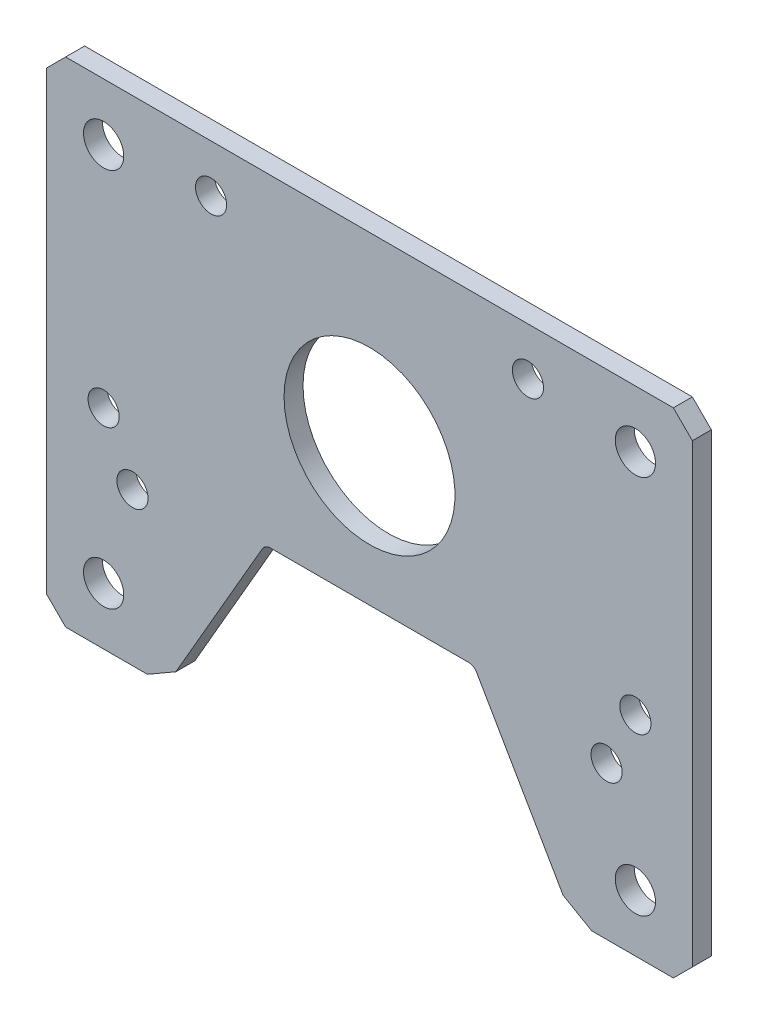
ISO-10303-21;
HEADER;
FILE_DESCRIPTION(('STEP AP214'),'2;1');
FILE_NAME('part.step','',(''),(''),'','','');
FILE_SCHEMA(('AUTOMOTIVE_DESIGN { 1 0 10303 214 1 1 1 1 }'));
ENDSEC;
DATA;
#1=APPLICATION_CONTEXT('core data for automotive mechanical design processes');
#2=APPLICATION_PROTOCOL_DEFINITION('international standard','automotive_design',2000,#1);
#3=PRODUCT_CONTEXT('',#1,'mechanical');
#4=PRODUCT('Part','Part','',(#3));
#5=PRODUCT_RELATED_PRODUCT_CATEGORY('part','',(#4));
#6=PRODUCT_DEFINITION_FORMATION('','',#4);
#7=PRODUCT_DEFINITION_CONTEXT('part definition',#1,'design');
#8=PRODUCT_DEFINITION('design','',#6,#7);
#9=PRODUCT_DEFINITION_SHAPE('','',#8);
#10=(LENGTH_UNIT() NAMED_UNIT(*) SI_UNIT(.MILLI.,.METRE.));
#11=(NAMED_UNIT(*) PLANE_ANGLE_UNIT() SI_UNIT($,.RADIAN.));
#12=(NAMED_UNIT(*) SI_UNIT($,.STERADIAN.) SOLID_ANGLE_UNIT());
#13=UNCERTAINTY_MEASURE_WITH_UNIT(LENGTH_MEASURE(1.E-05),#10,'distance_accuracy_value','');
#14=(GEOMETRIC_REPRESENTATION_CONTEXT(3) GLOBAL_UNCERTAINTY_ASSIGNED_CONTEXT((#13)) GLOBAL_UNIT_ASSIGNED_CONTEXT((#10,
#11,#12)) REPRESENTATION_CONTEXT('',''));
#15=CARTESIAN_POINT('',(0.,0.,0.));
#16=DIRECTION('',(0.,0.,1.));
#17=DIRECTION('',(1.,0.,0.));
#18=AXIS2_PLACEMENT_3D('',#15,#16,#17);
#19=CARTESIAN_POINT('',(-16.5459564477,-1.5875,3.175));
#20=DIRECTION('',(0.,0.,1.));
#21=DIRECTION('',(1.,0.,0.));
#22=AXIS2_PLACEMENT_3D('',#19,#20,#21);
#23=CYLINDRICAL_SURFACE('',#22,1.5875);
#24=DIRECTION('',(0.,0.,1.));
#25=VECTOR('',#24,1.);
#26=CARTESIAN_POINT('',(-17.9207717761507,-0.793749999970738,3.175));
#27=LINE('',#26,#25);
#28=CARTESIAN_POINT('',(-17.9207717761394,-0.793750000009797,3.175));
#29=VERTEX_POINT('',#28);
#30=CARTESIAN_POINT('',(-17.9207717761641,-0.793749999993925,0.));
#31=VERTEX_POINT('',#30);
#32=EDGE_CURVE('E195',#29,#31,#27,.F.);
#33=ORIENTED_EDGE('',*,*,#32,.T.);
#34=CARTESIAN_POINT('',(-16.5459564477,-1.5875,0.));
#35=DIRECTION('',(0.,0.,1.));
#36=DIRECTION('',(1.,0.,0.));
#37=AXIS2_PLACEMENT_3D('',#34,#35,#36);
#38=CIRCLE('',#37,1.5875);
#39=CARTESIAN_POINT('',(-16.5459564479,0.,0.));
#40=VERTEX_POINT('',#39);
#41=EDGE_CURVE('E143',#31,#40,#38,.F.);
#42=ORIENTED_EDGE('',*,*,#41,.T.);
#43=DIRECTION('',(0.,0.,1.));
#44=VECTOR('',#43,1.);
#45=CARTESIAN_POINT('',(-16.5459564481,0.,3.175));
#46=LINE('',#45,#44);
#47=CARTESIAN_POINT('',(-16.5459564479,0.,3.175));
#48=VERTEX_POINT('',#47);
#49=EDGE_CURVE('E141',#40,#48,#46,.T.);
#50=ORIENTED_EDGE('',*,*,#49,.T.);
#51=CARTESIAN_POINT('',(-16.5459564477,-1.5875,3.175));
#52=DIRECTION('',(0.,0.,1.));
#53=DIRECTION('',(1.,0.,0.));
#54=AXIS2_PLACEMENT_3D('',#51,#52,#53);
#55=CIRCLE('',#54,1.5875);
#56=EDGE_CURVE('E20',#29,#48,#55,.F.);
#57=ORIENTED_EDGE('',*,*,#56,.F.);
#58=EDGE_LOOP('',(#33,#42,#50,#57));
#59=FACE_BOUND('',#58,.T.);
#60=ADVANCED_FACE('F17',(#59),#23,.F.);
#61=CARTESIAN_POINT('',(16.5459564477,-1.5875,3.175));
#62=DIRECTION('',(0.,0.,1.));
#63=DIRECTION('',(1.,0.,0.));
#64=AXIS2_PLACEMENT_3D('',#61,#62,#63);
#65=CYLINDRICAL_SURFACE('',#64,1.5875);
#66=DIRECTION('',(0.,0.,1.));
#67=VECTOR('',#66,1.);
#68=CARTESIAN_POINT('',(16.5459564473,0.,3.175));
#69=LINE('',#68,#67);
#70=CARTESIAN_POINT('',(16.5459564475,0.,3.175));
#71=VERTEX_POINT('',#70);
#72=CARTESIAN_POINT('',(16.5459564475,0.,0.));
#73=VERTEX_POINT('',#72);
#74=EDGE_CURVE('E147',#71,#73,#69,.F.);
#75=ORIENTED_EDGE('',*,*,#74,.T.);
#76=CARTESIAN_POINT('',(16.5459564477,-1.5875,0.));
#77=DIRECTION('',(0.,0.,1.));
#78=DIRECTION('',(1.,0.,0.));
#79=AXIS2_PLACEMENT_3D('',#76,#77,#78);
#80=CIRCLE('',#79,1.5875);
#81=CARTESIAN_POINT('',(17.920771776078,-0.793749999841539,0.));
#82=VERTEX_POINT('',#81);
#83=EDGE_CURVE('E268',#73,#82,#80,.F.);
#84=ORIENTED_EDGE('',*,*,#83,.T.);
#85=DIRECTION('',(0.,0.,1.));
#86=VECTOR('',#85,1.);
#87=CARTESIAN_POINT('',(17.9207717759771,-0.793749999666797,3.175));
#88=LINE('',#87,#86);
#89=CARTESIAN_POINT('',(17.9207717760997,-0.793749999852652,3.175));
#90=VERTEX_POINT('',#89);
#91=EDGE_CURVE('E178',#82,#90,#88,.T.);
#92=ORIENTED_EDGE('',*,*,#91,.T.);
#93=CARTESIAN_POINT('',(16.5459564477,-1.5875,3.175));
#94=DIRECTION('',(0.,0.,1.));
#95=DIRECTION('',(1.,0.,0.));
#96=AXIS2_PLACEMENT_3D('',#93,#94,#95);
#97=CIRCLE('',#96,1.5875);
#98=EDGE_CURVE('E139',#71,#90,#97,.F.);
#99=ORIENTED_EDGE('',*,*,#98,.F.);
#100=EDGE_LOOP('',(#75,#84,#92,#99));
#101=FACE_BOUND('',#100,.T.);
#102=ADVANCED_FACE('F372',(#101),#65,.F.);
#103=CARTESIAN_POINT('',(-53.975,-28.575,0.));
#104=DIRECTION('',(0.,0.,1.));
#105=DIRECTION('',(1.,0.,0.));
#106=AXIS2_PLACEMENT_3D('',#103,#104,#105);
#107=PLANE('',#106);
#108=CARTESIAN_POINT('',(44.45,6.35,0.));
#109=DIRECTION('',(0.,0.,-1.));
#110=DIRECTION('',(-1.,0.,0.));
#111=AXIS2_PLACEMENT_3D('',#108,#109,#110);
#112=CIRCLE('',#111,2.6035);
#113=CARTESIAN_POINT('',(41.8465,6.35,0.));
#114=VERTEX_POINT('',#113);
#115=EDGE_CURVE('E252',#114,#114,#112,.F.);
#116=ORIENTED_EDGE('',*,*,#115,.T.);
#117=EDGE_LOOP('',(#116));
#118=FACE_BOUND('',#117,.T.);
#119=CARTESIAN_POINT('',(26.4841012048,46.0057498115,0.));
#120=DIRECTION('',(0.,0.,-1.));
#121=DIRECTION('',(-1.,0.,0.));
#122=AXIS2_PLACEMENT_3D('',#119,#120,#121);
#123=CIRCLE('',#122,2.6035);
#124=CARTESIAN_POINT('',(23.8806012048,46.0057498115,0.));
#125=VERTEX_POINT('',#124);
#126=EDGE_CURVE('E339',#125,#125,#123,.F.);
#127=ORIENTED_EDGE('',*,*,#126,.T.);
#128=EDGE_LOOP('',(#127));
#129=FACE_BOUND('',#128,.T.);
#130=CARTESIAN_POINT('',(-39.632108696,-3.063282164,0.));
#131=DIRECTION('',(0.,0.,-1.));
#132=DIRECTION('',(-1.,0.,0.));
#133=AXIS2_PLACEMENT_3D('',#130,#131,#132);
#134=CIRCLE('',#133,2.6035);
#135=CARTESIAN_POINT('',(-42.235608696,-3.063282164,0.));
#136=VERTEX_POINT('',#135);
#137=EDGE_CURVE('E342',#136,#136,#134,.F.);
#138=ORIENTED_EDGE('',*,*,#137,.T.);
#139=EDGE_LOOP('',(#138));
#140=FACE_BOUND('',#139,.T.);
#141=CARTESIAN_POINT('',(44.45,-19.05,0.));
#142=DIRECTION('',(0.,0.,-1.));
#143=DIRECTION('',(-1.,0.,0.));
#144=AXIS2_PLACEMENT_3D('',#141,#142,#143);
#145=CIRCLE('',#144,3.3655);
#146=CARTESIAN_POINT('',(41.0845,-19.05,0.));
#147=VERTEX_POINT('',#146);
#148=EDGE_CURVE('E345',#147,#147,#145,.F.);
#149=ORIENTED_EDGE('',*,*,#148,.T.);
#150=EDGE_LOOP('',(#149));
#151=FACE_BOUND('',#150,.T.);
#152=CARTESIAN_POINT('',(44.45,44.45,0.));
#153=DIRECTION('',(0.,0.,-1.));
#154=DIRECTION('',(-1.,0.,0.));
#155=AXIS2_PLACEMENT_3D('',#152,#153,#154);
#156=CIRCLE('',#155,3.3655);
#157=CARTESIAN_POINT('',(41.0845,44.45,0.));
#158=VERTEX_POINT('',#157);
#159=EDGE_CURVE('E348',#158,#158,#156,.F.);
#160=ORIENTED_EDGE('',*,*,#159,.T.);
#161=EDGE_LOOP('',(#160));
#162=FACE_BOUND('',#161,.T.);
#163=CARTESIAN_POINT('',(0.,23.058733918,0.));
#164=DIRECTION('',(0.,0.,-1.));
#165=DIRECTION('',(-1.,0.,0.));
#166=AXIS2_PLACEMENT_3D('',#163,#164,#165);
#167=CIRCLE('',#166,14.2875);
#168=CARTESIAN_POINT('',(-14.2875,23.058733918,0.));
#169=VERTEX_POINT('',#168);
#170=EDGE_CURVE('E351',#169,#169,#167,.F.);
#171=ORIENTED_EDGE('',*,*,#170,.T.);
#172=EDGE_LOOP('',(#171));
#173=FACE_BOUND('',#172,.T.);
#174=CARTESIAN_POINT('',(-44.45,44.45,0.));
#175=DIRECTION('',(0.,0.,-1.));
#176=DIRECTION('',(-1.,0.,0.));
#177=AXIS2_PLACEMENT_3D('',#174,#175,#176);
#178=CIRCLE('',#177,3.3655);
#179=CARTESIAN_POINT('',(-47.8155,44.45,0.));
#180=VERTEX_POINT('',#179);
#181=EDGE_CURVE('E354',#180,#180,#178,.F.);
#182=ORIENTED_EDGE('',*,*,#181,.T.);
#183=EDGE_LOOP('',(#182));
#184=FACE_BOUND('',#183,.T.);
#185=CARTESIAN_POINT('',(-44.45,-19.05,-7.45058095080742E-10));
#186=DIRECTION('',(0.,0.,-1.));
#187=DIRECTION('',(-1.,0.,0.));
#188=AXIS2_PLACEMENT_3D('',#185,#186,#187);
#189=CIRCLE('',#188,3.3655);
#190=CARTESIAN_POINT('',(-47.8155,-19.05,-7.45058095080742E-10));
#191=VERTEX_POINT('',#190);
#192=EDGE_CURVE('E357',#191,#191,#189,.F.);
#193=ORIENTED_EDGE('',*,*,#192,.T.);
#194=EDGE_LOOP('',(#193));
#195=FACE_BOUND('',#194,.T.);
#196=CARTESIAN_POINT('',(-44.45,6.35,0.));
#197=DIRECTION('',(0.,0.,-1.));
#198=DIRECTION('',(-1.,0.,0.));
#199=AXIS2_PLACEMENT_3D('',#196,#197,#198);
#200=CIRCLE('',#199,2.6035);
#201=CARTESIAN_POINT('',(-47.0535,6.35,0.));
#202=VERTEX_POINT('',#201);
#203=EDGE_CURVE('E360',#202,#202,#200,.F.);
#204=ORIENTED_EDGE('',*,*,#203,.T.);
#205=EDGE_LOOP('',(#204));
#206=FACE_BOUND('',#205,.T.);
#207=CARTESIAN_POINT('',(-26.4841012048,46.0057498115,0.));
#208=DIRECTION('',(0.,0.,-1.));
#209=DIRECTION('',(-1.,0.,0.));
#210=AXIS2_PLACEMENT_3D('',#207,#208,#209);
#211=CIRCLE('',#210,2.6035);
#212=CARTESIAN_POINT('',(-29.0876012048,46.0057498115,0.));
#213=VERTEX_POINT('',#212);
#214=EDGE_CURVE('E363',#213,#213,#211,.F.);
#215=ORIENTED_EDGE('',*,*,#214,.T.);
#216=EDGE_LOOP('',(#215));
#217=FACE_BOUND('',#216,.T.);
#218=CARTESIAN_POINT('',(39.632108696,-3.063282164,0.));
#219=DIRECTION('',(0.,0.,-1.));
#220=DIRECTION('',(-1.,0.,0.));
#221=AXIS2_PLACEMENT_3D('',#218,#219,#220);
#222=CIRCLE('',#221,2.6035);
#223=CARTESIAN_POINT('',(37.028608696,-3.063282164,0.));
#224=VERTEX_POINT('',#223);
#225=EDGE_CURVE('E165',#224,#224,#222,.F.);
#226=ORIENTED_EDGE('',*,*,#225,.T.);
#227=EDGE_LOOP('',(#226));
#228=FACE_BOUND('',#227,.T.);
#229=DIRECTION('',(0.707106781186548,0.707106781186548,0.));
#230=VECTOR('',#229,1.);
#231=CARTESIAN_POINT('',(-53.975,50.8,0.));
#232=LINE('',#231,#230);
#233=CARTESIAN_POINT('',(-53.975,50.8,0.));
#234=VERTEX_POINT('',#233);
#235=CARTESIAN_POINT('',(-50.7999999993,53.9750000004667,0.));
#236=VERTEX_POINT('',#235);
#237=EDGE_CURVE('E247',#234,#236,#232,.T.);
#238=ORIENTED_EDGE('',*,*,#237,.T.);
#239=DIRECTION('',(1.,0.,0.));
#240=VECTOR('',#239,1.);
#241=CARTESIAN_POINT('',(-53.975,53.975,0.));
#242=LINE('',#241,#240);
#243=CARTESIAN_POINT('',(50.79999999985,53.9750000001,0.));
#244=VERTEX_POINT('',#243);
#245=EDGE_CURVE('E266',#236,#244,#242,.T.);
#246=ORIENTED_EDGE('',*,*,#245,.T.);
#247=DIRECTION('',(0.707106781186548,-0.707106781186548,0.));
#248=VECTOR('',#247,1.);
#249=CARTESIAN_POINT('',(50.8,53.975,0.));
#250=LINE('',#249,#248);
#251=CARTESIAN_POINT('',(53.9749999995625,50.8000000000875,0.));
#252=VERTEX_POINT('',#251);
#253=EDGE_CURVE('E166',#244,#252,#250,.T.);
#254=ORIENTED_EDGE('',*,*,#253,.T.);
#255=DIRECTION('',(0.,1.,0.));
#256=VECTOR('',#255,1.);
#257=CARTESIAN_POINT('',(53.975,53.975,0.));
#258=LINE('',#257,#256);
#259=CARTESIAN_POINT('',(53.974999999825,-25.39999999965,0.));
#260=VERTEX_POINT('',#259);
#261=EDGE_CURVE('E167',#252,#260,#258,.F.);
#262=ORIENTED_EDGE('',*,*,#261,.T.);
#263=DIRECTION('',(-0.707106781186548,-0.707106781186548,0.));
#264=VECTOR('',#263,1.);
#265=CARTESIAN_POINT('',(53.975,-25.4,0.));
#266=LINE('',#265,#264);
#267=CARTESIAN_POINT('',(50.80000000035,-28.57499999995,0.));
#268=VERTEX_POINT('',#267);
#269=EDGE_CURVE('E175',#260,#268,#266,.T.);
#270=ORIENTED_EDGE('',*,*,#269,.T.);
#271=DIRECTION('',(-1.,0.,0.));
#272=VECTOR('',#271,1.);
#273=CARTESIAN_POINT('',(33.9602839421,-28.575,0.));
#274=LINE('',#273,#272);
#275=CARTESIAN_POINT('',(37.1352839427,-28.5750000003464,0.));
#276=VERTEX_POINT('',#275);
#277=EDGE_CURVE('E177',#268,#276,#274,.T.);
#278=ORIENTED_EDGE('',*,*,#277,.T.);
#279=DIRECTION('',(-0.866025403784329,0.50000000000019,0.));
#280=VECTOR('',#279,1.);
#281=CARTESIAN_POINT('',(37.1352839421,-28.575,0.));
#282=LINE('',#281,#280);
#283=CARTESIAN_POINT('',(32.3727839422435,-25.8253693430989,0.));
#284=VERTEX_POINT('',#283);
#285=EDGE_CURVE('E181',#276,#284,#282,.T.);
#286=ORIENTED_EDGE('',*,*,#285,.T.);
#287=DIRECTION('',(-0.50000000000019,0.866025403784329,0.));
#288=VECTOR('',#287,1.);
#289=CARTESIAN_POINT('',(17.4625,0.,0.));
#290=LINE('',#289,#288);
#291=EDGE_CURVE('E182',#284,#82,#290,.T.);
#292=ORIENTED_EDGE('',*,*,#291,.T.);
#293=ORIENTED_EDGE('',*,*,#83,.F.);
#294=DIRECTION('',(-1.,0.,0.));
#295=VECTOR('',#294,1.);
#296=CARTESIAN_POINT('',(-17.4625,0.,0.));
#297=LINE('',#296,#295);
#298=EDGE_CURVE('E194',#73,#40,#297,.T.);
#299=ORIENTED_EDGE('',*,*,#298,.T.);
#300=ORIENTED_EDGE('',*,*,#41,.F.);
#301=DIRECTION('',(-0.50000000000019,-0.866025403784329,0.));
#302=VECTOR('',#301,1.);
#303=CARTESIAN_POINT('',(-33.9602839421,-28.575,0.));
#304=LINE('',#303,#302);
#305=CARTESIAN_POINT('',(-32.3727839426605,-25.8253693436958,0.));
#306=VERTEX_POINT('',#305);
#307=EDGE_CURVE('E148',#31,#306,#304,.T.);
#308=ORIENTED_EDGE('',*,*,#307,.T.);
#309=DIRECTION('',(-0.866025403784329,-0.50000000000019,0.));
#310=VECTOR('',#309,1.);
#311=CARTESIAN_POINT('',(-32.3727839421,-25.825369343,0.));
#312=LINE('',#311,#310);
#313=CARTESIAN_POINT('',(-37.1352839418676,-28.5749999999219,0.));
#314=VERTEX_POINT('',#313);
#315=EDGE_CURVE('E207',#306,#314,#312,.T.);
#316=ORIENTED_EDGE('',*,*,#315,.T.);
#317=DIRECTION('',(1.,0.,0.));
#318=VECTOR('',#317,1.);
#319=CARTESIAN_POINT('',(-53.975,-28.575,0.));
#320=LINE('',#319,#318);
#321=CARTESIAN_POINT('',(-50.7999999994167,-28.5750000001167,0.));
#322=VERTEX_POINT('',#321);
#323=EDGE_CURVE('E217',#314,#322,#320,.F.);
#324=ORIENTED_EDGE('',*,*,#323,.T.);
#325=DIRECTION('',(-0.707106781186548,0.707106781186548,0.));
#326=VECTOR('',#325,1.);
#327=CARTESIAN_POINT('',(-50.8,-28.575,0.));
#328=LINE('',#327,#326);
#329=CARTESIAN_POINT('',(-53.9750000002333,-25.39999999965,0.));
#330=VERTEX_POINT('',#329);
#331=EDGE_CURVE('E227',#322,#330,#328,.T.);
#332=ORIENTED_EDGE('',*,*,#331,.T.);
#333=DIRECTION('',(0.,1.,0.));
#334=VECTOR('',#333,1.);
#335=CARTESIAN_POINT('',(-53.975,53.975,0.));
#336=LINE('',#335,#334);
#337=EDGE_CURVE('E237',#330,#234,#336,.T.);
#338=ORIENTED_EDGE('',*,*,#337,.T.);
#339=EDGE_LOOP('',(#238,#246,#254,#262,#270,#278,#286,#292,#293,#299,#300,#308,#316,#324,#332,#338));
#340=FACE_BOUND('',#339,.T.);
#341=ADVANCED_FACE('F398',(#118,#129,#140,#151,#162,#173,#184,#195,#206,#217,#228,#340),#107,.F.);
#342=CARTESIAN_POINT('',(-53.975,53.975,3.175));
#343=DIRECTION('',(0.,-1.,0.));
#344=DIRECTION('',(0.,0.,-1.));
#345=AXIS2_PLACEMENT_3D('',#342,#343,#344);
#346=PLANE('',#345);
#347=DIRECTION('',(0.,0.,1.));
#348=VECTOR('',#347,1.);
#349=CARTESIAN_POINT('',(-50.7999999993,53.9750000007,3.175));
#350=LINE('',#349,#348);
#351=CARTESIAN_POINT('',(-50.7999999993,53.9750000007,3.175));
#352=VERTEX_POINT('',#351);
#353=EDGE_CURVE('E245',#236,#352,#350,.T.);
#354=ORIENTED_EDGE('',*,*,#353,.T.);
#355=DIRECTION('',(1.,0.,0.));
#356=VECTOR('',#355,1.);
#357=CARTESIAN_POINT('',(-53.975,53.9750000007,3.175));
#358=LINE('',#357,#356);
#359=CARTESIAN_POINT('',(50.8000000000792,53.9750000005625,3.175));
#360=VERTEX_POINT('',#359);
#361=EDGE_CURVE('E242',#360,#352,#358,.F.);
#362=ORIENTED_EDGE('',*,*,#361,.F.);
#363=DIRECTION('',(0.,0.,1.));
#364=VECTOR('',#363,1.);
#365=CARTESIAN_POINT('',(50.79999999985,53.97500000015,3.175));
#366=LINE('',#365,#364);
#367=EDGE_CURVE('E170',#360,#244,#366,.F.);
#368=ORIENTED_EDGE('',*,*,#367,.T.);
#369=ORIENTED_EDGE('',*,*,#245,.F.);
#370=EDGE_LOOP('',(#354,#362,#368,#369));
#371=FACE_BOUND('',#370,.T.);
#372=ADVANCED_FACE('F405',(#371),#346,.F.);
#373=CARTESIAN_POINT('',(-53.975,50.8,3.175));
#374=DIRECTION('',(0.707106781186548,-0.707106781186548,0.));
#375=DIRECTION('',(0.707106781186548,0.707106781186548,0.));
#376=AXIS2_PLACEMENT_3D('',#373,#374,#375);
#377=PLANE('',#376);
#378=ORIENTED_EDGE('',*,*,#353,.F.);
#379=ORIENTED_EDGE('',*,*,#237,.F.);
#380=DIRECTION('',(0.,0.,-1.));
#381=VECTOR('',#380,1.);
#382=CARTESIAN_POINT('',(-53.975,50.8,3.175));
#383=LINE('',#382,#381);
#384=CARTESIAN_POINT('',(-53.975,50.8,3.175));
#385=VERTEX_POINT('',#384);
#386=EDGE_CURVE('E235',#234,#385,#383,.F.);
#387=ORIENTED_EDGE('',*,*,#386,.T.);
#388=DIRECTION('',(-0.707106781186548,-0.707106781186547,0.));
#389=VECTOR('',#388,1.);
#390=CARTESIAN_POINT('',(-50.7999999993,53.9750000007,3.175));
#391=LINE('',#390,#389);
#392=EDGE_CURVE('E232',#352,#385,#391,.T.);
#393=ORIENTED_EDGE('',*,*,#392,.F.);
#394=EDGE_LOOP('',(#378,#379,#387,#393));
#395=FACE_BOUND('',#394,.T.);
#396=ADVANCED_FACE('F410',(#395),#377,.F.);
#397=CARTESIAN_POINT('',(-53.975,53.975,3.175));
#398=DIRECTION('',(1.,0.,0.));
#399=DIRECTION('',(0.,0.,-1.));
#400=AXIS2_PLACEMENT_3D('',#397,#398,#399);
#401=PLANE('',#400);
#402=ORIENTED_EDGE('',*,*,#386,.F.);
#403=ORIENTED_EDGE('',*,*,#337,.F.);
#404=DIRECTION('',(0.,0.,1.));
#405=VECTOR('',#404,1.);
#406=CARTESIAN_POINT('',(-53.97500000035,-25.39999999965,3.175));
#407=LINE('',#406,#405);
#408=CARTESIAN_POINT('',(-53.9750000001167,-25.3999999994167,3.175));
#409=VERTEX_POINT('',#408);
#410=EDGE_CURVE('E218',#330,#409,#407,.T.);
#411=ORIENTED_EDGE('',*,*,#410,.T.);
#412=DIRECTION('',(0.,1.,0.));
#413=VECTOR('',#412,1.);
#414=CARTESIAN_POINT('',(-53.975,-28.575,3.175));
#415=LINE('',#414,#413);
#416=EDGE_CURVE('E223',#385,#409,#415,.F.);
#417=ORIENTED_EDGE('',*,*,#416,.F.);
#418=EDGE_LOOP('',(#402,#403,#411,#417));
#419=FACE_BOUND('',#418,.T.);
#420=ADVANCED_FACE('F415',(#419),#401,.F.);
#421=CARTESIAN_POINT('',(-50.8,-28.575,3.175));
#422=DIRECTION('',(0.707106781186548,0.707106781186548,0.));
#423=DIRECTION('',(-0.707106781186548,0.707106781186548,0.));
#424=AXIS2_PLACEMENT_3D('',#421,#422,#423);
#425=PLANE('',#424);
#426=ORIENTED_EDGE('',*,*,#410,.F.);
#427=ORIENTED_EDGE('',*,*,#331,.F.);
#428=DIRECTION('',(0.,0.,1.));
#429=VECTOR('',#428,1.);
#430=CARTESIAN_POINT('',(-50.7999999993,-28.575,3.175));
#431=LINE('',#430,#429);
#432=CARTESIAN_POINT('',(-50.7999999993,-28.575,3.175));
#433=VERTEX_POINT('',#432);
#434=EDGE_CURVE('E215',#322,#433,#431,.T.);
#435=ORIENTED_EDGE('',*,*,#434,.T.);
#436=DIRECTION('',(0.707106781186547,-0.707106781186547,0.));
#437=VECTOR('',#436,1.);
#438=CARTESIAN_POINT('',(-53.975,-25.3999999993,3.175));
#439=LINE('',#438,#437);
#440=EDGE_CURVE('E212',#409,#433,#439,.T.);
#441=ORIENTED_EDGE('',*,*,#440,.F.);
#442=EDGE_LOOP('',(#426,#427,#435,#441));
#443=FACE_BOUND('',#442,.T.);
#444=ADVANCED_FACE('F419',(#443),#425,.F.);
#445=CARTESIAN_POINT('',(-53.975,-28.575,3.175));
#446=DIRECTION('',(0.,1.,0.));
#447=DIRECTION('',(0.,0.,1.));
#448=AXIS2_PLACEMENT_3D('',#445,#446,#447);
#449=PLANE('',#448);
#450=DIRECTION('',(0.,0.,1.));
#451=VECTOR('',#450,1.);
#452=CARTESIAN_POINT('',(-37.1352839418676,-28.5749999998828,3.175));
#453=LINE('',#452,#451);
#454=CARTESIAN_POINT('',(-37.1352839418225,-28.5749999999609,3.175));
#455=VERTEX_POINT('',#454);
#456=EDGE_CURVE('E199',#314,#455,#453,.T.);
#457=ORIENTED_EDGE('',*,*,#456,.T.);
#458=DIRECTION('',(1.,0.,0.));
#459=VECTOR('',#458,1.);
#460=CARTESIAN_POINT('',(-53.975,-28.575,3.175));
#461=LINE('',#460,#459);
#462=EDGE_CURVE('E203',#433,#455,#461,.T.);
#463=ORIENTED_EDGE('',*,*,#462,.F.);
#464=ORIENTED_EDGE('',*,*,#434,.F.);
#465=ORIENTED_EDGE('',*,*,#323,.F.);
#466=EDGE_LOOP('',(#457,#463,#464,#465));
#467=FACE_BOUND('',#466,.T.);
#468=ADVANCED_FACE('F424',(#467),#449,.F.);
#469=CARTESIAN_POINT('',(-32.3727839421,-25.825369343,3.175));
#470=DIRECTION('',(-0.50000000000019,0.866025403784329,0.));
#471=DIRECTION('',(-0.866025403784329,-0.50000000000019,0.));
#472=AXIS2_PLACEMENT_3D('',#469,#470,#471);
#473=PLANE('',#472);
#474=ORIENTED_EDGE('',*,*,#456,.F.);
#475=ORIENTED_EDGE('',*,*,#315,.F.);
#476=DIRECTION('',(0.,0.,1.));
#477=VECTOR('',#476,1.);
#478=CARTESIAN_POINT('',(-32.3727839425959,-25.8253693438447,3.175));
#479=LINE('',#478,#477);
#480=CARTESIAN_POINT('',(-32.372783942532,-25.8253693438815,3.175));
#481=VERTEX_POINT('',#480);
#482=EDGE_CURVE('E197',#306,#481,#479,.T.);
#483=ORIENTED_EDGE('',*,*,#482,.T.);
#484=DIRECTION('',(0.86602540382471,0.499999999930248,0.));
#485=VECTOR('',#484,1.);
#486=CARTESIAN_POINT('',(-37.1352839418,-28.575,3.175));
#487=LINE('',#486,#485);
#488=EDGE_CURVE('E157',#455,#481,#487,.T.);
#489=ORIENTED_EDGE('',*,*,#488,.F.);
#490=EDGE_LOOP('',(#474,#475,#483,#489));
#491=FACE_BOUND('',#490,.T.);
#492=ADVANCED_FACE('F428',(#491),#473,.F.);
#493=CARTESIAN_POINT('',(-33.9602839421,-28.575,3.175));
#494=DIRECTION('',(-0.866025403784329,0.50000000000019,0.));
#495=DIRECTION('',(-0.50000000000019,-0.866025403784329,0.));
#496=AXIS2_PLACEMENT_3D('',#493,#494,#495);
#497=PLANE('',#496);
#498=ORIENTED_EDGE('',*,*,#32,.F.);
#499=DIRECTION('',(0.499999999998627,0.866025403785231,0.));
#500=VECTOR('',#499,1.);
#501=CARTESIAN_POINT('',(-32.3727839425,-25.8253693439,3.175));
#502=LINE('',#501,#500);
#503=EDGE_CURVE('E138',#481,#29,#502,.T.);
#504=ORIENTED_EDGE('',*,*,#503,.F.);
#505=ORIENTED_EDGE('',*,*,#482,.F.);
#506=ORIENTED_EDGE('',*,*,#307,.F.);
#507=EDGE_LOOP('',(#498,#504,#505,#506));
#508=FACE_BOUND('',#507,.T.);
#509=ADVANCED_FACE('F432',(#508),#497,.F.);
#510=CARTESIAN_POINT('',(-17.4625,0.,3.175));
#511=DIRECTION('',(0.,1.,0.));
#512=DIRECTION('',(-1.,0.,0.));
#513=AXIS2_PLACEMENT_3D('',#510,#511,#512);
#514=PLANE('',#513);
#515=ORIENTED_EDGE('',*,*,#74,.F.);
#516=DIRECTION('',(1.,0.,0.));
#517=VECTOR('',#516,1.);
#518=CARTESIAN_POINT('',(-53.975,0.,3.175));
#519=LINE('',#518,#517);
#520=EDGE_CURVE('E135',#48,#71,#519,.T.);
#521=ORIENTED_EDGE('',*,*,#520,.F.);
#522=ORIENTED_EDGE('',*,*,#49,.F.);
#523=ORIENTED_EDGE('',*,*,#298,.F.);
#524=EDGE_LOOP('',(#515,#521,#522,#523));
#525=FACE_BOUND('',#524,.T.);
#526=ADVANCED_FACE('F151',(#525),#514,.F.);
#527=CARTESIAN_POINT('',(17.4625,0.,3.175));
#528=DIRECTION('',(0.866025403784329,0.50000000000019,0.));
#529=DIRECTION('',(-0.50000000000019,0.866025403784329,0.));
#530=AXIS2_PLACEMENT_3D('',#527,#528,#529);
#531=PLANE('',#530);
#532=ORIENTED_EDGE('',*,*,#91,.F.);
#533=ORIENTED_EDGE('',*,*,#291,.F.);
#534=DIRECTION('',(0.,0.,1.));
#535=VECTOR('',#534,1.);
#536=CARTESIAN_POINT('',(32.3727839422721,-25.8253693430824,3.175));
#537=LINE('',#536,#535);
#538=CARTESIAN_POINT('',(32.3727839419574,-25.8253693436275,3.175));
#539=VERTEX_POINT('',#538);
#540=EDGE_CURVE('E188',#284,#539,#537,.T.);
#541=ORIENTED_EDGE('',*,*,#540,.T.);
#542=DIRECTION('',(0.499999999977869,-0.866025403797216,0.));
#543=VECTOR('',#542,1.);
#544=CARTESIAN_POINT('',(17.9207717762,-0.793749999999999,3.175));
#545=LINE('',#544,#543);
#546=EDGE_CURVE('E152',#90,#539,#545,.T.);
#547=ORIENTED_EDGE('',*,*,#546,.F.);
#548=EDGE_LOOP('',(#532,#533,#541,#547));
#549=FACE_BOUND('',#548,.T.);
#550=ADVANCED_FACE('F376',(#549),#531,.F.);
#551=CARTESIAN_POINT('',(37.1352839421,-28.575,3.175));
#552=DIRECTION('',(0.50000000000019,0.866025403784329,0.));
#553=DIRECTION('',(-0.866025403784329,0.50000000000019,0.));
#554=AXIS2_PLACEMENT_3D('',#551,#552,#553);
#555=PLANE('',#554);
#556=ORIENTED_EDGE('',*,*,#540,.F.);
#557=ORIENTED_EDGE('',*,*,#285,.F.);
#558=DIRECTION('',(0.,0.,1.));
#559=VECTOR('',#558,1.);
#560=CARTESIAN_POINT('',(37.1352839429,-28.575,3.175));
#561=LINE('',#560,#559);
#562=CARTESIAN_POINT('',(37.1352839428,-28.5750000001732,3.175));
#563=VERTEX_POINT('',#562);
#564=EDGE_CURVE('E190',#276,#563,#561,.T.);
#565=ORIENTED_EDGE('',*,*,#564,.T.);
#566=DIRECTION('',(0.866025403906539,-0.499999999788516,0.));
#567=VECTOR('',#566,1.);
#568=CARTESIAN_POINT('',(32.3727839418,-25.8253693439,3.175));
#569=LINE('',#568,#567);
#570=EDGE_CURVE('E155',#539,#563,#569,.T.);
#571=ORIENTED_EDGE('',*,*,#570,.F.);
#572=EDGE_LOOP('',(#556,#557,#565,#571));
#573=FACE_BOUND('',#572,.T.);
#574=ADVANCED_FACE('F380',(#573),#555,.F.);
#575=CARTESIAN_POINT('',(33.9602839421,-28.575,3.175));
#576=DIRECTION('',(0.,1.,0.));
#577=DIRECTION('',(-1.,0.,0.));
#578=AXIS2_PLACEMENT_3D('',#575,#576,#577);
#579=PLANE('',#578);
#580=DIRECTION('',(0.,0.,1.));
#581=VECTOR('',#580,1.);
#582=CARTESIAN_POINT('',(50.8000000002,-28.5749999998,3.175));
#583=LINE('',#582,#581);
#584=CARTESIAN_POINT('',(50.80000000035,-28.57499999995,3.175));
#585=VERTEX_POINT('',#584);
#586=EDGE_CURVE('E173',#268,#585,#583,.T.);
#587=ORIENTED_EDGE('',*,*,#586,.T.);
#588=DIRECTION('',(1.,0.,0.));
#589=VECTOR('',#588,1.);
#590=CARTESIAN_POINT('',(-53.975,-28.575,3.175));
#591=LINE('',#590,#589);
#592=EDGE_CURVE('E185',#563,#585,#591,.T.);
#593=ORIENTED_EDGE('',*,*,#592,.F.);
#594=ORIENTED_EDGE('',*,*,#564,.F.);
#595=ORIENTED_EDGE('',*,*,#277,.F.);
#596=EDGE_LOOP('',(#587,#593,#594,#595));
#597=FACE_BOUND('',#596,.T.);
#598=ADVANCED_FACE('F433',(#597),#579,.F.);
#599=CARTESIAN_POINT('',(53.975,-25.4,3.175));
#600=DIRECTION('',(-0.707106781186548,0.707106781186548,0.));
#601=DIRECTION('',(-0.707106781186548,-0.707106781186548,0.));
#602=AXIS2_PLACEMENT_3D('',#599,#600,#601);
#603=PLANE('',#602);
#604=ORIENTED_EDGE('',*,*,#586,.F.);
#605=ORIENTED_EDGE('',*,*,#269,.F.);
#606=DIRECTION('',(0.,0.,1.));
#607=VECTOR('',#606,1.);
#608=CARTESIAN_POINT('',(53.975,-25.3999999993,3.175));
#609=LINE('',#608,#607);
#610=CARTESIAN_POINT('',(53.974999999825,-25.39999999965,3.175));
#611=VERTEX_POINT('',#610);
#612=EDGE_CURVE('E171',#260,#611,#609,.T.);
#613=ORIENTED_EDGE('',*,*,#612,.T.);
#614=DIRECTION('',(0.70710678098611,0.707106781386986,0.));
#615=VECTOR('',#614,1.);
#616=CARTESIAN_POINT('',(50.8000000004,-28.575,3.175));
#617=LINE('',#616,#615);
#618=EDGE_CURVE('E386',#585,#611,#617,.T.);
#619=ORIENTED_EDGE('',*,*,#618,.F.);
#620=EDGE_LOOP('',(#604,#605,#613,#619));
#621=FACE_BOUND('',#620,.T.);
#622=ADVANCED_FACE('F395',(#621),#603,.F.);
#623=CARTESIAN_POINT('',(53.975,53.975,3.175));
#624=DIRECTION('',(-1.,0.,0.));
#625=DIRECTION('',(0.,0.,1.));
#626=AXIS2_PLACEMENT_3D('',#623,#624,#625);
#627=PLANE('',#626);
#628=DIRECTION('',(0.,0.,1.));
#629=VECTOR('',#628,1.);
#630=CARTESIAN_POINT('',(53.97499999965,50.80000000035,3.175));
#631=LINE('',#630,#629);
#632=CARTESIAN_POINT('',(53.9749999997375,50.8000000000875,3.175));
#633=VERTEX_POINT('',#632);
#634=EDGE_CURVE('E35',#252,#633,#631,.T.);
#635=ORIENTED_EDGE('',*,*,#634,.T.);
#636=DIRECTION('',(0.,1.,0.));
#637=VECTOR('',#636,1.);
#638=CARTESIAN_POINT('',(53.9749999993,-28.575,3.175));
#639=LINE('',#638,#637);
#640=EDGE_CURVE('E263',#611,#633,#639,.T.);
#641=ORIENTED_EDGE('',*,*,#640,.F.);
#642=ORIENTED_EDGE('',*,*,#612,.F.);
#643=ORIENTED_EDGE('',*,*,#261,.F.);
#644=EDGE_LOOP('',(#635,#641,#642,#643));
#645=FACE_BOUND('',#644,.T.);
#646=ADVANCED_FACE('F392',(#645),#627,.F.);
#647=CARTESIAN_POINT('',(50.8,53.975,3.175));
#648=DIRECTION('',(-0.707106781186548,-0.707106781186548,0.));
#649=DIRECTION('',(0.707106781186548,-0.707106781186548,0.));
#650=AXIS2_PLACEMENT_3D('',#647,#648,#649);
#651=PLANE('',#650);
#652=ORIENTED_EDGE('',*,*,#634,.F.);
#653=ORIENTED_EDGE('',*,*,#253,.F.);
#654=ORIENTED_EDGE('',*,*,#367,.F.);
#655=DIRECTION('',(-0.70710678098611,0.707106781386985,0.));
#656=VECTOR('',#655,1.);
#657=CARTESIAN_POINT('',(53.9749999993,50.8,3.175));
#658=LINE('',#657,#656);
#659=EDGE_CURVE('E259',#633,#360,#658,.T.);
#660=ORIENTED_EDGE('',*,*,#659,.F.);
#661=EDGE_LOOP('',(#652,#653,#654,#660));
#662=FACE_BOUND('',#661,.T.);
#663=ADVANCED_FACE('F403',(#662),#651,.F.);
#664=CARTESIAN_POINT('',(39.632108696,-3.063282164,3.175));
#665=DIRECTION('',(0.,0.,-1.));
#666=DIRECTION('',(-1.,0.,0.));
#667=AXIS2_PLACEMENT_3D('',#664,#665,#666);
#668=CYLINDRICAL_SURFACE('',#667,2.6035);
#669=CARTESIAN_POINT('',(39.632108696,-3.063282164,3.175));
#670=DIRECTION('',(0.,0.,-1.));
#671=DIRECTION('',(-1.,0.,0.));
#672=AXIS2_PLACEMENT_3D('',#669,#670,#671);
#673=CIRCLE('',#672,2.6035);
#674=CARTESIAN_POINT('',(37.028608696,-3.063282164,3.175));
#675=VERTEX_POINT('',#674);
#676=EDGE_CURVE('E262',#675,#675,#673,.T.);
#677=ORIENTED_EDGE('',*,*,#676,.F.);
#678=EDGE_LOOP('',(#677));
#679=FACE_BOUND('',#678,.T.);
#680=ORIENTED_EDGE('',*,*,#225,.F.);
#681=EDGE_LOOP('',(#680));
#682=FACE_BOUND('',#681,.T.);
#683=ADVANCED_FACE('F489',(#679,#682),#668,.F.);
#684=CARTESIAN_POINT('',(-26.4841012048,46.0057498115,3.175));
#685=DIRECTION('',(0.,0.,-1.));
#686=DIRECTION('',(-1.,0.,0.));
#687=AXIS2_PLACEMENT_3D('',#684,#685,#686);
#688=CYLINDRICAL_SURFACE('',#687,2.6035);
#689=CARTESIAN_POINT('',(-26.4841012048,46.0057498115,3.175));
#690=DIRECTION('',(0.,0.,-1.));
#691=DIRECTION('',(-1.,0.,0.));
#692=AXIS2_PLACEMENT_3D('',#689,#690,#691);
#693=CIRCLE('',#692,2.6035);
#694=CARTESIAN_POINT('',(-29.0876012048,46.0057498115,3.175));
#695=VERTEX_POINT('',#694);
#696=EDGE_CURVE('E332',#695,#695,#693,.T.);
#697=ORIENTED_EDGE('',*,*,#696,.F.);
#698=EDGE_LOOP('',(#697));
#699=FACE_BOUND('',#698,.T.);
#700=ORIENTED_EDGE('',*,*,#214,.F.);
#701=EDGE_LOOP('',(#700));
#702=FACE_BOUND('',#701,.T.);
#703=ADVANCED_FACE('F485',(#699,#702),#688,.F.);
#704=CARTESIAN_POINT('',(-44.45,6.35,3.175));
#705=DIRECTION('',(0.,0.,-1.));
#706=DIRECTION('',(-1.,0.,0.));
#707=AXIS2_PLACEMENT_3D('',#704,#705,#706);
#708=CYLINDRICAL_SURFACE('',#707,2.6035);
#709=CARTESIAN_POINT('',(-44.45,6.35,3.175));
#710=DIRECTION('',(0.,0.,-1.));
#711=DIRECTION('',(-1.,0.,0.));
#712=AXIS2_PLACEMENT_3D('',#709,#710,#711);
#713=CIRCLE('',#712,2.6035);
#714=CARTESIAN_POINT('',(-47.0535,6.35,3.175));
#715=VERTEX_POINT('',#714);
#716=EDGE_CURVE('E329',#715,#715,#713,.T.);
#717=ORIENTED_EDGE('',*,*,#716,.F.);
#718=EDGE_LOOP('',(#717));
#719=FACE_BOUND('',#718,.T.);
#720=ORIENTED_EDGE('',*,*,#203,.F.);
#721=EDGE_LOOP('',(#720));
#722=FACE_BOUND('',#721,.T.);
#723=ADVANCED_FACE('F481',(#719,#722),#708,.F.);
#724=CARTESIAN_POINT('',(-44.45,-19.05,3.175));
#725=DIRECTION('',(0.,0.,-1.));
#726=DIRECTION('',(-1.,0.,0.));
#727=AXIS2_PLACEMENT_3D('',#724,#725,#726);
#728=CYLINDRICAL_SURFACE('',#727,3.3655);
#729=CARTESIAN_POINT('',(-44.45,-19.05,3.175));
#730=DIRECTION('',(0.,0.,-1.));
#731=DIRECTION('',(-1.,0.,0.));
#732=AXIS2_PLACEMENT_3D('',#729,#730,#731);
#733=CIRCLE('',#732,3.3655);
#734=CARTESIAN_POINT('',(-47.8155,-19.05,3.175));
#735=VERTEX_POINT('',#734);
#736=EDGE_CURVE('E326',#735,#735,#733,.T.);
#737=ORIENTED_EDGE('',*,*,#736,.F.);
#738=EDGE_LOOP('',(#737));
#739=FACE_BOUND('',#738,.T.);
#740=ORIENTED_EDGE('',*,*,#192,.F.);
#741=EDGE_LOOP('',(#740));
#742=FACE_BOUND('',#741,.T.);
#743=ADVANCED_FACE('F477',(#739,#742),#728,.F.);
#744=CARTESIAN_POINT('',(-44.45,44.45,3.175));
#745=DIRECTION('',(0.,0.,-1.));
#746=DIRECTION('',(-1.,0.,0.));
#747=AXIS2_PLACEMENT_3D('',#744,#745,#746);
#748=CYLINDRICAL_SURFACE('',#747,3.3655);
#749=CARTESIAN_POINT('',(-44.45,44.45,3.175));
#750=DIRECTION('',(0.,0.,-1.));
#751=DIRECTION('',(-1.,0.,0.));
#752=AXIS2_PLACEMENT_3D('',#749,#750,#751);
#753=CIRCLE('',#752,3.3655);
#754=CARTESIAN_POINT('',(-47.8155,44.45,3.175));
#755=VERTEX_POINT('',#754);
#756=EDGE_CURVE('E323',#755,#755,#753,.T.);
#757=ORIENTED_EDGE('',*,*,#756,.F.);
#758=EDGE_LOOP('',(#757));
#759=FACE_BOUND('',#758,.T.);
#760=ORIENTED_EDGE('',*,*,#181,.F.);
#761=EDGE_LOOP('',(#760));
#762=FACE_BOUND('',#761,.T.);
#763=ADVANCED_FACE('F473',(#759,#762),#748,.F.);
#764=CARTESIAN_POINT('',(0.,23.058733918,3.175));
#765=DIRECTION('',(0.,0.,-1.));
#766=DIRECTION('',(-1.,0.,0.));
#767=AXIS2_PLACEMENT_3D('',#764,#765,#766);
#768=CYLINDRICAL_SURFACE('',#767,14.2875);
#769=CARTESIAN_POINT('',(0.,23.058733918,3.175));
#770=DIRECTION('',(0.,0.,-1.));
#771=DIRECTION('',(-1.,0.,0.));
#772=AXIS2_PLACEMENT_3D('',#769,#770,#771);
#773=CIRCLE('',#772,14.2875);
#774=CARTESIAN_POINT('',(-14.2875,23.058733918,3.175));
#775=VERTEX_POINT('',#774);
#776=EDGE_CURVE('E320',#775,#775,#773,.T.);
#777=ORIENTED_EDGE('',*,*,#776,.F.);
#778=EDGE_LOOP('',(#777));
#779=FACE_BOUND('',#778,.T.);
#780=ORIENTED_EDGE('',*,*,#170,.F.);
#781=EDGE_LOOP('',(#780));
#782=FACE_BOUND('',#781,.T.);
#783=ADVANCED_FACE('F469',(#779,#782),#768,.F.);
#784=CARTESIAN_POINT('',(44.45,44.45,3.175));
#785=DIRECTION('',(0.,0.,-1.));
#786=DIRECTION('',(-1.,0.,0.));
#787=AXIS2_PLACEMENT_3D('',#784,#785,#786);
#788=CYLINDRICAL_SURFACE('',#787,3.3655);
#789=CARTESIAN_POINT('',(44.45,44.45,3.175));
#790=DIRECTION('',(0.,0.,-1.));
#791=DIRECTION('',(-1.,0.,0.));
#792=AXIS2_PLACEMENT_3D('',#789,#790,#791);
#793=CIRCLE('',#792,3.3655);
#794=CARTESIAN_POINT('',(41.0845,44.45,3.175));
#795=VERTEX_POINT('',#794);
#796=EDGE_CURVE('E317',#795,#795,#793,.T.);
#797=ORIENTED_EDGE('',*,*,#796,.F.);
#798=EDGE_LOOP('',(#797));
#799=FACE_BOUND('',#798,.T.);
#800=ORIENTED_EDGE('',*,*,#159,.F.);
#801=EDGE_LOOP('',(#800));
#802=FACE_BOUND('',#801,.T.);
#803=ADVANCED_FACE('F465',(#799,#802),#788,.F.);
#804=CARTESIAN_POINT('',(44.45,-19.05,3.175));
#805=DIRECTION('',(0.,0.,-1.));
#806=DIRECTION('',(-1.,0.,0.));
#807=AXIS2_PLACEMENT_3D('',#804,#805,#806);
#808=CYLINDRICAL_SURFACE('',#807,3.3655);
#809=CARTESIAN_POINT('',(44.45,-19.05,3.175));
#810=DIRECTION('',(0.,0.,-1.));
#811=DIRECTION('',(-1.,0.,0.));
#812=AXIS2_PLACEMENT_3D('',#809,#810,#811);
#813=CIRCLE('',#812,3.3655);
#814=CARTESIAN_POINT('',(41.0845,-19.05,3.175));
#815=VERTEX_POINT('',#814);
#816=EDGE_CURVE('E314',#815,#815,#813,.T.);
#817=ORIENTED_EDGE('',*,*,#816,.F.);
#818=EDGE_LOOP('',(#817));
#819=FACE_BOUND('',#818,.T.);
#820=ORIENTED_EDGE('',*,*,#148,.F.);
#821=EDGE_LOOP('',(#820));
#822=FACE_BOUND('',#821,.T.);
#823=ADVANCED_FACE('F461',(#819,#822),#808,.F.);
#824=CARTESIAN_POINT('',(-39.632108696,-3.063282164,3.175));
#825=DIRECTION('',(0.,0.,-1.));
#826=DIRECTION('',(-1.,0.,0.));
#827=AXIS2_PLACEMENT_3D('',#824,#825,#826);
#828=CYLINDRICAL_SURFACE('',#827,2.6035);
#829=CARTESIAN_POINT('',(-39.632108696,-3.063282164,3.175));
#830=DIRECTION('',(0.,0.,-1.));
#831=DIRECTION('',(-1.,0.,0.));
#832=AXIS2_PLACEMENT_3D('',#829,#830,#831);
#833=CIRCLE('',#832,2.6035);
#834=CARTESIAN_POINT('',(-42.235608696,-3.063282164,3.175));
#835=VERTEX_POINT('',#834);
#836=EDGE_CURVE('E311',#835,#835,#833,.T.);
#837=ORIENTED_EDGE('',*,*,#836,.F.);
#838=EDGE_LOOP('',(#837));
#839=FACE_BOUND('',#838,.T.);
#840=ORIENTED_EDGE('',*,*,#137,.F.);
#841=EDGE_LOOP('',(#840));
#842=FACE_BOUND('',#841,.T.);
#843=ADVANCED_FACE('F457',(#839,#842),#828,.F.);
#844=CARTESIAN_POINT('',(26.4841012048,46.0057498115,3.175));
#845=DIRECTION('',(0.,0.,-1.));
#846=DIRECTION('',(-1.,0.,0.));
#847=AXIS2_PLACEMENT_3D('',#844,#845,#846);
#848=CYLINDRICAL_SURFACE('',#847,2.6035);
#849=CARTESIAN_POINT('',(26.4841012048,46.0057498115,3.175));
#850=DIRECTION('',(0.,0.,-1.));
#851=DIRECTION('',(-1.,0.,0.));
#852=AXIS2_PLACEMENT_3D('',#849,#850,#851);
#853=CIRCLE('',#852,2.6035);
#854=CARTESIAN_POINT('',(23.8806012048,46.0057498115,3.175));
#855=VERTEX_POINT('',#854);
#856=EDGE_CURVE('E26',#855,#855,#853,.T.);
#857=ORIENTED_EDGE('',*,*,#856,.F.);
#858=EDGE_LOOP('',(#857));
#859=FACE_BOUND('',#858,.T.);
#860=ORIENTED_EDGE('',*,*,#126,.F.);
#861=EDGE_LOOP('',(#860));
#862=FACE_BOUND('',#861,.T.);
#863=ADVANCED_FACE('F450',(#859,#862),#848,.F.);
#864=CARTESIAN_POINT('',(44.45,6.35,3.175));
#865=DIRECTION('',(0.,0.,-1.));
#866=DIRECTION('',(-1.,0.,0.));
#867=AXIS2_PLACEMENT_3D('',#864,#865,#866);
#868=CYLINDRICAL_SURFACE('',#867,2.6035);
#869=CARTESIAN_POINT('',(44.45,6.35,3.175));
#870=DIRECTION('',(0.,0.,-1.));
#871=DIRECTION('',(-1.,0.,0.));
#872=AXIS2_PLACEMENT_3D('',#869,#870,#871);
#873=CIRCLE('',#872,2.6035);
#874=CARTESIAN_POINT('',(41.8465,6.35,3.175));
#875=VERTEX_POINT('',#874);
#876=EDGE_CURVE('E11',#875,#875,#873,.T.);
#877=ORIENTED_EDGE('',*,*,#876,.F.);
#878=EDGE_LOOP('',(#877));
#879=FACE_BOUND('',#878,.T.);
#880=ORIENTED_EDGE('',*,*,#115,.F.);
#881=EDGE_LOOP('',(#880));
#882=FACE_BOUND('',#881,.T.);
#883=ADVANCED_FACE('F444',(#879,#882),#868,.F.);
#884=CARTESIAN_POINT('',(-53.975,-28.575,3.175));
#885=DIRECTION('',(0.,0.,1.));
#886=DIRECTION('',(1.,0.,0.));
#887=AXIS2_PLACEMENT_3D('',#884,#885,#886);
#888=PLANE('',#887);
#889=ORIENTED_EDGE('',*,*,#876,.T.);
#890=EDGE_LOOP('',(#889));
#891=FACE_BOUND('',#890,.T.);
#892=ORIENTED_EDGE('',*,*,#856,.T.);
#893=EDGE_LOOP('',(#892));
#894=FACE_BOUND('',#893,.T.);
#895=ORIENTED_EDGE('',*,*,#836,.T.);
#896=EDGE_LOOP('',(#895));
#897=FACE_BOUND('',#896,.T.);
#898=ORIENTED_EDGE('',*,*,#816,.T.);
#899=EDGE_LOOP('',(#898));
#900=FACE_BOUND('',#899,.T.);
#901=ORIENTED_EDGE('',*,*,#796,.T.);
#902=EDGE_LOOP('',(#901));
#903=FACE_BOUND('',#902,.T.);
#904=ORIENTED_EDGE('',*,*,#776,.T.);
#905=EDGE_LOOP('',(#904));
#906=FACE_BOUND('',#905,.T.);
#907=ORIENTED_EDGE('',*,*,#756,.T.);
#908=EDGE_LOOP('',(#907));
#909=FACE_BOUND('',#908,.T.);
#910=ORIENTED_EDGE('',*,*,#736,.T.);
#911=EDGE_LOOP('',(#910));
#912=FACE_BOUND('',#911,.T.);
#913=ORIENTED_EDGE('',*,*,#716,.T.);
#914=EDGE_LOOP('',(#913));
#915=FACE_BOUND('',#914,.T.);
#916=ORIENTED_EDGE('',*,*,#696,.T.);
#917=EDGE_LOOP('',(#916));
#918=FACE_BOUND('',#917,.T.);
#919=ORIENTED_EDGE('',*,*,#676,.T.);
#920=EDGE_LOOP('',(#919));
#921=FACE_BOUND('',#920,.T.);
#922=ORIENTED_EDGE('',*,*,#640,.T.);
#923=ORIENTED_EDGE('',*,*,#659,.T.);
#924=ORIENTED_EDGE('',*,*,#361,.T.);
#925=ORIENTED_EDGE('',*,*,#392,.T.);
#926=ORIENTED_EDGE('',*,*,#416,.T.);
#927=ORIENTED_EDGE('',*,*,#440,.T.);
#928=ORIENTED_EDGE('',*,*,#462,.T.);
#929=ORIENTED_EDGE('',*,*,#488,.T.);
#930=ORIENTED_EDGE('',*,*,#503,.T.);
#931=ORIENTED_EDGE('',*,*,#56,.T.);
#932=ORIENTED_EDGE('',*,*,#520,.T.);
#933=ORIENTED_EDGE('',*,*,#98,.T.);
#934=ORIENTED_EDGE('',*,*,#546,.T.);
#935=ORIENTED_EDGE('',*,*,#570,.T.);
#936=ORIENTED_EDGE('',*,*,#592,.T.);
#937=ORIENTED_EDGE('',*,*,#618,.T.);
#938=EDGE_LOOP('',(#922,#923,#924,#925,#926,#927,#928,#929,#930,#931,#932,#933,#934,#935,#936,#937));
#939=FACE_BOUND('',#938,.T.);
#940=ADVANCED_FACE('F133',(#891,#894,#897,#900,#903,#906,#909,#912,#915,#918,#921,#939),#888,.T.);
#941=CLOSED_SHELL('',(#60,#102,#341,#372,#396,#420,#444,#468,#492,#509,#526,#550,#574,#598,#622,
#646,#663,#683,#703,#723,#743,#763,#783,#803,#823,#843,#863,#883,#940));
#942=MANIFOLD_SOLID_BREP('B1',#941);
#943=ADVANCED_BREP_SHAPE_REPRESENTATION('',(#18,#942),#14);
#944=SHAPE_DEFINITION_REPRESENTATION(#9,#943);
ENDSEC;
END-ISO-10303-21;
